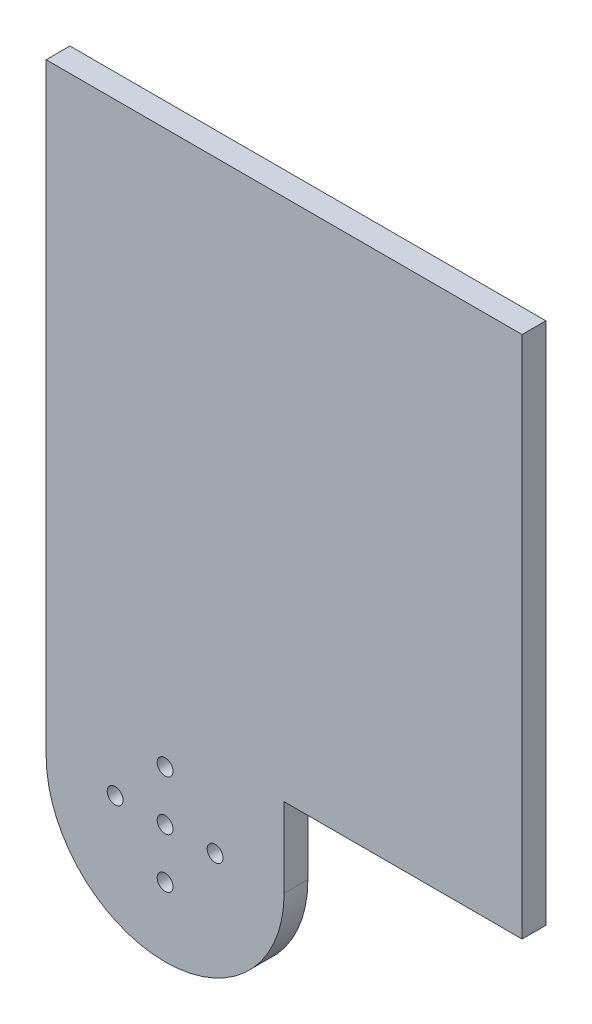
ISO-10303-21;
HEADER;
FILE_DESCRIPTION(('STEP AP214'),'2;1');
FILE_NAME('part.step','',(''),(''),'','','');
FILE_SCHEMA(('AUTOMOTIVE_DESIGN { 1 0 10303 214 1 1 1 1 }'));
ENDSEC;
DATA;
#1=APPLICATION_CONTEXT('core data for automotive mechanical design processes');
#2=APPLICATION_PROTOCOL_DEFINITION('international standard','automotive_design',2000,#1);
#3=PRODUCT_CONTEXT('',#1,'mechanical');
#4=PRODUCT('Part','Part','',(#3));
#5=PRODUCT_RELATED_PRODUCT_CATEGORY('part','',(#4));
#6=PRODUCT_DEFINITION_FORMATION('','',#4);
#7=PRODUCT_DEFINITION_CONTEXT('part definition',#1,'design');
#8=PRODUCT_DEFINITION('design','',#6,#7);
#9=PRODUCT_DEFINITION_SHAPE('','',#8);
#10=(LENGTH_UNIT() NAMED_UNIT(*) SI_UNIT(.MILLI.,.METRE.));
#11=(NAMED_UNIT(*) PLANE_ANGLE_UNIT() SI_UNIT($,.RADIAN.));
#12=(NAMED_UNIT(*) SI_UNIT($,.STERADIAN.) SOLID_ANGLE_UNIT());
#13=UNCERTAINTY_MEASURE_WITH_UNIT(LENGTH_MEASURE(1.E-05),#10,'distance_accuracy_value','');
#14=(GEOMETRIC_REPRESENTATION_CONTEXT(3) GLOBAL_UNCERTAINTY_ASSIGNED_CONTEXT((#13)) GLOBAL_UNIT_ASSIGNED_CONTEXT((#10,
#11,#12)) REPRESENTATION_CONTEXT('',''));
#15=CARTESIAN_POINT('',(0.,0.,0.));
#16=DIRECTION('',(0.,0.,1.));
#17=DIRECTION('',(1.,0.,0.));
#18=AXIS2_PLACEMENT_3D('',#15,#16,#17);
#19=CARTESIAN_POINT('',(15.,0.,-3.));
#20=DIRECTION('',(-1.,0.,0.));
#21=DIRECTION('',(0.,0.,1.));
#22=AXIS2_PLACEMENT_3D('',#19,#20,#21);
#23=PLANE('',#22);
#24=DIRECTION('',(0.,0.,-1.));
#25=VECTOR('',#24,1.);
#26=CARTESIAN_POINT('',(15.,9.99999999999999,0.));
#27=LINE('',#26,#25);
#28=CARTESIAN_POINT('',(15.,9.99999999999999,0.));
#29=VERTEX_POINT('',#28);
#30=CARTESIAN_POINT('',(15.,9.99999999999999,-3.));
#31=VERTEX_POINT('',#30);
#32=EDGE_CURVE('E118',#29,#31,#27,.T.);
#33=ORIENTED_EDGE('',*,*,#32,.F.);
#34=DIRECTION('',(0.,-1.,0.));
#35=VECTOR('',#34,1.);
#36=CARTESIAN_POINT('',(15.,0.,0.));
#37=LINE('',#36,#35);
#38=CARTESIAN_POINT('',(15.,0.,0.));
#39=VERTEX_POINT('',#38);
#40=EDGE_CURVE('E122',#29,#39,#37,.T.);
#41=ORIENTED_EDGE('',*,*,#40,.T.);
#42=DIRECTION('',(0.,0.,1.));
#43=VECTOR('',#42,1.);
#44=CARTESIAN_POINT('',(15.,0.,-3.));
#45=LINE('',#44,#43);
#46=CARTESIAN_POINT('',(15.,0.,-3.));
#47=VERTEX_POINT('',#46);
#48=EDGE_CURVE('E43',#47,#39,#45,.T.);
#49=ORIENTED_EDGE('',*,*,#48,.F.);
#50=DIRECTION('',(0.,-1.,0.));
#51=VECTOR('',#50,1.);
#52=CARTESIAN_POINT('',(15.,0.,-3.));
#53=LINE('',#52,#51);
#54=EDGE_CURVE('E56',#31,#47,#53,.T.);
#55=ORIENTED_EDGE('',*,*,#54,.F.);
#56=EDGE_LOOP('',(#33,#41,#49,#55));
#57=FACE_BOUND('',#56,.T.);
#58=ADVANCED_FACE('F39',(#57),#23,.F.);
#59=CARTESIAN_POINT('',(0.,0.,-3.));
#60=DIRECTION('',(0.,0.,1.));
#61=DIRECTION('',(1.,0.,0.));
#62=AXIS2_PLACEMENT_3D('',#59,#60,#61);
#63=CYLINDRICAL_SURFACE('',#62,15.);
#64=CARTESIAN_POINT('',(0.,0.,0.));
#65=DIRECTION('',(0.,0.,1.));
#66=DIRECTION('',(1.,0.,0.));
#67=AXIS2_PLACEMENT_3D('',#64,#65,#66);
#68=CIRCLE('',#67,15.);
#69=CARTESIAN_POINT('',(-15.,0.,0.));
#70=VERTEX_POINT('',#69);
#71=EDGE_CURVE('E166',#70,#39,#68,.T.);
#72=ORIENTED_EDGE('',*,*,#71,.F.);
#73=DIRECTION('',(0.,0.,1.));
#74=VECTOR('',#73,1.);
#75=CARTESIAN_POINT('',(-15.,0.,-3.));
#76=LINE('',#75,#74);
#77=CARTESIAN_POINT('',(-15.,0.,-3.));
#78=VERTEX_POINT('',#77);
#79=EDGE_CURVE('E11',#78,#70,#76,.T.);
#80=ORIENTED_EDGE('',*,*,#79,.F.);
#81=CARTESIAN_POINT('',(0.,0.,-3.));
#82=DIRECTION('',(0.,0.,1.));
#83=DIRECTION('',(1.,0.,0.));
#84=AXIS2_PLACEMENT_3D('',#81,#82,#83);
#85=CIRCLE('',#84,15.);
#86=EDGE_CURVE('E147',#78,#47,#85,.T.);
#87=ORIENTED_EDGE('',*,*,#86,.T.);
#88=ORIENTED_EDGE('',*,*,#48,.T.);
#89=EDGE_LOOP('',(#72,#80,#87,#88));
#90=FACE_BOUND('',#89,.T.);
#91=ADVANCED_FACE('F175',(#90),#63,.T.);
#92=CARTESIAN_POINT('',(-15.,0.,-3.));
#93=DIRECTION('',(1.,0.,0.));
#94=DIRECTION('',(0.,0.,-1.));
#95=AXIS2_PLACEMENT_3D('',#92,#93,#94);
#96=PLANE('',#95);
#97=DIRECTION('',(0.,1.,0.));
#98=VECTOR('',#97,1.);
#99=CARTESIAN_POINT('',(-15.,0.,0.));
#100=LINE('',#99,#98);
#101=CARTESIAN_POINT('',(-15.,76.,0.));
#102=VERTEX_POINT('',#101);
#103=EDGE_CURVE('E135',#70,#102,#100,.T.);
#104=ORIENTED_EDGE('',*,*,#103,.T.);
#105=DIRECTION('',(0.,0.,1.));
#106=VECTOR('',#105,1.);
#107=CARTESIAN_POINT('',(-15.,76.,-3.));
#108=LINE('',#107,#106);
#109=CARTESIAN_POINT('',(-15.,76.,-3.));
#110=VERTEX_POINT('',#109);
#111=EDGE_CURVE('E48',#110,#102,#108,.T.);
#112=ORIENTED_EDGE('',*,*,#111,.F.);
#113=DIRECTION('',(0.,1.,0.));
#114=VECTOR('',#113,1.);
#115=CARTESIAN_POINT('',(-15.,0.,-3.));
#116=LINE('',#115,#114);
#117=EDGE_CURVE('E152',#78,#110,#116,.T.);
#118=ORIENTED_EDGE('',*,*,#117,.F.);
#119=ORIENTED_EDGE('',*,*,#79,.T.);
#120=EDGE_LOOP('',(#104,#112,#118,#119));
#121=FACE_BOUND('',#120,.T.);
#122=ADVANCED_FACE('F176',(#121),#96,.F.);
#123=CARTESIAN_POINT('',(0.,76.,-3.));
#124=DIRECTION('',(0.,-1.,0.));
#125=DIRECTION('',(0.,0.,-1.));
#126=AXIS2_PLACEMENT_3D('',#123,#124,#125);
#127=PLANE('',#126);
#128=DIRECTION('',(1.,0.,0.));
#129=VECTOR('',#128,1.);
#130=CARTESIAN_POINT('',(0.,76.,0.));
#131=LINE('',#130,#129);
#132=CARTESIAN_POINT('',(45.,76.,0.));
#133=VERTEX_POINT('',#132);
#134=EDGE_CURVE('E169',#102,#133,#131,.T.);
#135=ORIENTED_EDGE('',*,*,#134,.T.);
#136=DIRECTION('',(0.,0.,1.));
#137=VECTOR('',#136,1.);
#138=CARTESIAN_POINT('',(45.,76.,0.));
#139=LINE('',#138,#137);
#140=CARTESIAN_POINT('',(45.,76.,-3.));
#141=VERTEX_POINT('',#140);
#142=EDGE_CURVE('E116',#141,#133,#139,.T.);
#143=ORIENTED_EDGE('',*,*,#142,.F.);
#144=DIRECTION('',(1.,0.,0.));
#145=VECTOR('',#144,1.);
#146=CARTESIAN_POINT('',(0.,76.,-3.));
#147=LINE('',#146,#145);
#148=EDGE_CURVE('E150',#110,#141,#147,.T.);
#149=ORIENTED_EDGE('',*,*,#148,.F.);
#150=ORIENTED_EDGE('',*,*,#111,.T.);
#151=EDGE_LOOP('',(#135,#143,#149,#150));
#152=FACE_BOUND('',#151,.T.);
#153=ADVANCED_FACE('F198',(#152),#127,.F.);
#154=CARTESIAN_POINT('',(0.,0.,-3.));
#155=DIRECTION('',(0.,0.,1.));
#156=DIRECTION('',(1.,0.,0.));
#157=AXIS2_PLACEMENT_3D('',#154,#155,#156);
#158=CYLINDRICAL_SURFACE('',#157,1.);
#159=CARTESIAN_POINT('',(0.,0.,-3.));
#160=DIRECTION('',(0.,0.,1.));
#161=DIRECTION('',(1.,0.,0.));
#162=AXIS2_PLACEMENT_3D('',#159,#160,#161);
#163=CIRCLE('',#162,1.);
#164=CARTESIAN_POINT('',(1.,0.,-3.));
#165=VERTEX_POINT('',#164);
#166=EDGE_CURVE('E144',#165,#165,#163,.T.);
#167=ORIENTED_EDGE('',*,*,#166,.F.);
#168=EDGE_LOOP('',(#167));
#169=FACE_BOUND('',#168,.T.);
#170=CARTESIAN_POINT('',(0.,0.,0.));
#171=DIRECTION('',(0.,0.,1.));
#172=DIRECTION('',(1.,0.,0.));
#173=AXIS2_PLACEMENT_3D('',#170,#171,#172);
#174=CIRCLE('',#173,1.);
#175=CARTESIAN_POINT('',(1.,0.,0.));
#176=VERTEX_POINT('',#175);
#177=EDGE_CURVE('E163',#176,#176,#174,.T.);
#178=ORIENTED_EDGE('',*,*,#177,.T.);
#179=EDGE_LOOP('',(#178));
#180=FACE_BOUND('',#179,.T.);
#181=ADVANCED_FACE('F201',(#169,#180),#158,.F.);
#182=CARTESIAN_POINT('',(6.3,0.,-3.));
#183=DIRECTION('',(0.,0.,1.));
#184=DIRECTION('',(1.,0.,0.));
#185=AXIS2_PLACEMENT_3D('',#182,#183,#184);
#186=CYLINDRICAL_SURFACE('',#185,1.);
#187=CARTESIAN_POINT('',(6.3,0.,-3.));
#188=DIRECTION('',(0.,0.,1.));
#189=DIRECTION('',(1.,0.,0.));
#190=AXIS2_PLACEMENT_3D('',#187,#188,#189);
#191=CIRCLE('',#190,1.);
#192=CARTESIAN_POINT('',(7.3,0.,-3.));
#193=VERTEX_POINT('',#192);
#194=EDGE_CURVE('E141',#193,#193,#191,.T.);
#195=ORIENTED_EDGE('',*,*,#194,.F.);
#196=EDGE_LOOP('',(#195));
#197=FACE_BOUND('',#196,.T.);
#198=CARTESIAN_POINT('',(6.3,0.,0.));
#199=DIRECTION('',(0.,0.,1.));
#200=DIRECTION('',(1.,0.,0.));
#201=AXIS2_PLACEMENT_3D('',#198,#199,#200);
#202=CIRCLE('',#201,1.);
#203=CARTESIAN_POINT('',(7.3,0.,0.));
#204=VERTEX_POINT('',#203);
#205=EDGE_CURVE('E160',#204,#204,#202,.T.);
#206=ORIENTED_EDGE('',*,*,#205,.T.);
#207=EDGE_LOOP('',(#206));
#208=FACE_BOUND('',#207,.T.);
#209=ADVANCED_FACE('F204',(#197,#208),#186,.F.);
#210=CARTESIAN_POINT('',(0.,-6.3,-3.));
#211=DIRECTION('',(0.,0.,1.));
#212=DIRECTION('',(1.,0.,0.));
#213=AXIS2_PLACEMENT_3D('',#210,#211,#212);
#214=CYLINDRICAL_SURFACE('',#213,1.);
#215=CARTESIAN_POINT('',(0.,-6.3,-3.));
#216=DIRECTION('',(0.,0.,1.));
#217=DIRECTION('',(1.,0.,0.));
#218=AXIS2_PLACEMENT_3D('',#215,#216,#217);
#219=CIRCLE('',#218,1.);
#220=CARTESIAN_POINT('',(1.,-6.3,-3.));
#221=VERTEX_POINT('',#220);
#222=EDGE_CURVE('E138',#221,#221,#219,.T.);
#223=ORIENTED_EDGE('',*,*,#222,.F.);
#224=EDGE_LOOP('',(#223));
#225=FACE_BOUND('',#224,.T.);
#226=CARTESIAN_POINT('',(0.,-6.3,0.));
#227=DIRECTION('',(0.,0.,1.));
#228=DIRECTION('',(1.,0.,0.));
#229=AXIS2_PLACEMENT_3D('',#226,#227,#228);
#230=CIRCLE('',#229,1.);
#231=CARTESIAN_POINT('',(1.,-6.3,0.));
#232=VERTEX_POINT('',#231);
#233=EDGE_CURVE('E157',#232,#232,#230,.T.);
#234=ORIENTED_EDGE('',*,*,#233,.T.);
#235=EDGE_LOOP('',(#234));
#236=FACE_BOUND('',#235,.T.);
#237=ADVANCED_FACE('F208',(#225,#236),#214,.F.);
#238=CARTESIAN_POINT('',(-6.3,0.,-3.));
#239=DIRECTION('',(0.,0.,1.));
#240=DIRECTION('',(1.,0.,0.));
#241=AXIS2_PLACEMENT_3D('',#238,#239,#240);
#242=CYLINDRICAL_SURFACE('',#241,1.);
#243=CARTESIAN_POINT('',(-6.3,0.,-3.));
#244=DIRECTION('',(0.,0.,1.));
#245=DIRECTION('',(1.,0.,0.));
#246=AXIS2_PLACEMENT_3D('',#243,#244,#245);
#247=CIRCLE('',#246,1.);
#248=CARTESIAN_POINT('',(-5.3,0.,-3.));
#249=VERTEX_POINT('',#248);
#250=EDGE_CURVE('E134',#249,#249,#247,.T.);
#251=ORIENTED_EDGE('',*,*,#250,.F.);
#252=EDGE_LOOP('',(#251));
#253=FACE_BOUND('',#252,.T.);
#254=CARTESIAN_POINT('',(-6.3,0.,0.));
#255=DIRECTION('',(0.,0.,1.));
#256=DIRECTION('',(1.,0.,0.));
#257=AXIS2_PLACEMENT_3D('',#254,#255,#256);
#258=CIRCLE('',#257,1.);
#259=CARTESIAN_POINT('',(-5.3,0.,0.));
#260=VERTEX_POINT('',#259);
#261=EDGE_CURVE('E126',#260,#260,#258,.T.);
#262=ORIENTED_EDGE('',*,*,#261,.T.);
#263=EDGE_LOOP('',(#262));
#264=FACE_BOUND('',#263,.T.);
#265=ADVANCED_FACE('F187',(#253,#264),#242,.F.);
#266=CARTESIAN_POINT('',(0.,6.3,-3.));
#267=DIRECTION('',(0.,0.,1.));
#268=DIRECTION('',(1.,0.,0.));
#269=AXIS2_PLACEMENT_3D('',#266,#267,#268);
#270=CYLINDRICAL_SURFACE('',#269,1.);
#271=CARTESIAN_POINT('',(0.,6.3,-3.));
#272=DIRECTION('',(0.,0.,1.));
#273=DIRECTION('',(1.,0.,0.));
#274=AXIS2_PLACEMENT_3D('',#271,#272,#273);
#275=CIRCLE('',#274,1.);
#276=CARTESIAN_POINT('',(1.,6.3,-3.));
#277=VERTEX_POINT('',#276);
#278=EDGE_CURVE('E131',#277,#277,#275,.T.);
#279=ORIENTED_EDGE('',*,*,#278,.F.);
#280=EDGE_LOOP('',(#279));
#281=FACE_BOUND('',#280,.T.);
#282=CARTESIAN_POINT('',(0.,6.3,0.));
#283=DIRECTION('',(0.,0.,1.));
#284=DIRECTION('',(1.,0.,0.));
#285=AXIS2_PLACEMENT_3D('',#282,#283,#284);
#286=CIRCLE('',#285,1.);
#287=CARTESIAN_POINT('',(1.,6.3,0.));
#288=VERTEX_POINT('',#287);
#289=EDGE_CURVE('E123',#288,#288,#286,.T.);
#290=ORIENTED_EDGE('',*,*,#289,.T.);
#291=EDGE_LOOP('',(#290));
#292=FACE_BOUND('',#291,.T.);
#293=ADVANCED_FACE('F41',(#281,#292),#270,.F.);
#294=CARTESIAN_POINT('',(0.,0.,-3.));
#295=DIRECTION('',(0.,0.,1.));
#296=DIRECTION('',(1.,0.,0.));
#297=AXIS2_PLACEMENT_3D('',#294,#295,#296);
#298=PLANE('',#297);
#299=ORIENTED_EDGE('',*,*,#278,.T.);
#300=EDGE_LOOP('',(#299));
#301=FACE_BOUND('',#300,.T.);
#302=ORIENTED_EDGE('',*,*,#250,.T.);
#303=EDGE_LOOP('',(#302));
#304=FACE_BOUND('',#303,.T.);
#305=ORIENTED_EDGE('',*,*,#222,.T.);
#306=EDGE_LOOP('',(#305));
#307=FACE_BOUND('',#306,.T.);
#308=ORIENTED_EDGE('',*,*,#194,.T.);
#309=EDGE_LOOP('',(#308));
#310=FACE_BOUND('',#309,.T.);
#311=ORIENTED_EDGE('',*,*,#166,.T.);
#312=EDGE_LOOP('',(#311));
#313=FACE_BOUND('',#312,.T.);
#314=ORIENTED_EDGE('',*,*,#86,.F.);
#315=ORIENTED_EDGE('',*,*,#117,.T.);
#316=ORIENTED_EDGE('',*,*,#148,.T.);
#317=DIRECTION('',(0.,1.,0.));
#318=VECTOR('',#317,1.);
#319=CARTESIAN_POINT('',(45.,76.,-3.));
#320=LINE('',#319,#318);
#321=CARTESIAN_POINT('',(45.,9.99999999999999,-3.00000000000001));
#322=VERTEX_POINT('',#321);
#323=EDGE_CURVE('E109',#322,#141,#320,.T.);
#324=ORIENTED_EDGE('',*,*,#323,.F.);
#325=DIRECTION('',(-1.,0.,0.));
#326=VECTOR('',#325,1.);
#327=CARTESIAN_POINT('',(45.,9.99999999999999,-3.00000000000001));
#328=LINE('',#327,#326);
#329=EDGE_CURVE('E105',#322,#31,#328,.T.);
#330=ORIENTED_EDGE('',*,*,#329,.T.);
#331=ORIENTED_EDGE('',*,*,#54,.T.);
#332=EDGE_LOOP('',(#314,#315,#316,#324,#330,#331));
#333=FACE_BOUND('',#332,.T.);
#334=ADVANCED_FACE('F177',(#301,#304,#307,#310,#313,#333),#298,.F.);
#335=CARTESIAN_POINT('',(0.,0.,0.));
#336=DIRECTION('',(0.,0.,1.));
#337=DIRECTION('',(1.,0.,0.));
#338=AXIS2_PLACEMENT_3D('',#335,#336,#337);
#339=PLANE('',#338);
#340=ORIENTED_EDGE('',*,*,#289,.F.);
#341=EDGE_LOOP('',(#340));
#342=FACE_BOUND('',#341,.T.);
#343=ORIENTED_EDGE('',*,*,#261,.F.);
#344=EDGE_LOOP('',(#343));
#345=FACE_BOUND('',#344,.T.);
#346=ORIENTED_EDGE('',*,*,#233,.F.);
#347=EDGE_LOOP('',(#346));
#348=FACE_BOUND('',#347,.T.);
#349=ORIENTED_EDGE('',*,*,#205,.F.);
#350=EDGE_LOOP('',(#349));
#351=FACE_BOUND('',#350,.T.);
#352=ORIENTED_EDGE('',*,*,#177,.F.);
#353=EDGE_LOOP('',(#352));
#354=FACE_BOUND('',#353,.T.);
#355=ORIENTED_EDGE('',*,*,#71,.T.);
#356=ORIENTED_EDGE('',*,*,#40,.F.);
#357=DIRECTION('',(-1.,0.,0.));
#358=VECTOR('',#357,1.);
#359=CARTESIAN_POINT('',(45.,9.99999999999999,0.));
#360=LINE('',#359,#358);
#361=CARTESIAN_POINT('',(45.,9.99999999999999,0.));
#362=VERTEX_POINT('',#361);
#363=EDGE_CURVE('E104',#362,#29,#360,.T.);
#364=ORIENTED_EDGE('',*,*,#363,.F.);
#365=DIRECTION('',(0.,-1.,0.));
#366=VECTOR('',#365,1.);
#367=CARTESIAN_POINT('',(45.,9.99999999999999,0.));
#368=LINE('',#367,#366);
#369=EDGE_CURVE('E110',#133,#362,#368,.T.);
#370=ORIENTED_EDGE('',*,*,#369,.F.);
#371=ORIENTED_EDGE('',*,*,#134,.F.);
#372=ORIENTED_EDGE('',*,*,#103,.F.);
#373=EDGE_LOOP('',(#355,#356,#364,#370,#371,#372));
#374=FACE_BOUND('',#373,.T.);
#375=ADVANCED_FACE('F121',(#342,#345,#348,#351,#354,#374),#339,.T.);
#376=CARTESIAN_POINT('',(45.,9.99999999999999,0.));
#377=DIRECTION('',(0.,1.,0.));
#378=DIRECTION('',(0.,0.,1.));
#379=AXIS2_PLACEMENT_3D('',#376,#377,#378);
#380=PLANE('',#379);
#381=ORIENTED_EDGE('',*,*,#32,.T.);
#382=ORIENTED_EDGE('',*,*,#329,.F.);
#383=DIRECTION('',(0.,0.,-1.));
#384=VECTOR('',#383,1.);
#385=CARTESIAN_POINT('',(45.,9.99999999999999,0.));
#386=LINE('',#385,#384);
#387=EDGE_CURVE('E100',#362,#322,#386,.T.);
#388=ORIENTED_EDGE('',*,*,#387,.F.);
#389=ORIENTED_EDGE('',*,*,#363,.T.);
#390=EDGE_LOOP('',(#381,#382,#388,#389));
#391=FACE_BOUND('',#390,.T.);
#392=ADVANCED_FACE('F102',(#391),#380,.F.);
#393=CARTESIAN_POINT('',(45.,0.,0.));
#394=DIRECTION('',(-1.,0.,0.));
#395=DIRECTION('',(0.,0.,1.));
#396=AXIS2_PLACEMENT_3D('',#393,#394,#395);
#397=PLANE('',#396);
#398=ORIENTED_EDGE('',*,*,#369,.T.);
#399=ORIENTED_EDGE('',*,*,#387,.T.);
#400=ORIENTED_EDGE('',*,*,#323,.T.);
#401=ORIENTED_EDGE('',*,*,#142,.T.);
#402=EDGE_LOOP('',(#398,#399,#400,#401));
#403=FACE_BOUND('',#402,.T.);
#404=ADVANCED_FACE('F114',(#403),#397,.F.);
#405=CLOSED_SHELL('',(#58,#91,#122,#153,#181,#209,#237,#265,#293,#334,#375,#392,#404));
#406=MANIFOLD_SOLID_BREP('B2',#405);
#407=ADVANCED_BREP_SHAPE_REPRESENTATION('',(#18,#406),#14);
#408=SHAPE_DEFINITION_REPRESENTATION(#9,#407);
ENDSEC;
END-ISO-10303-21;
